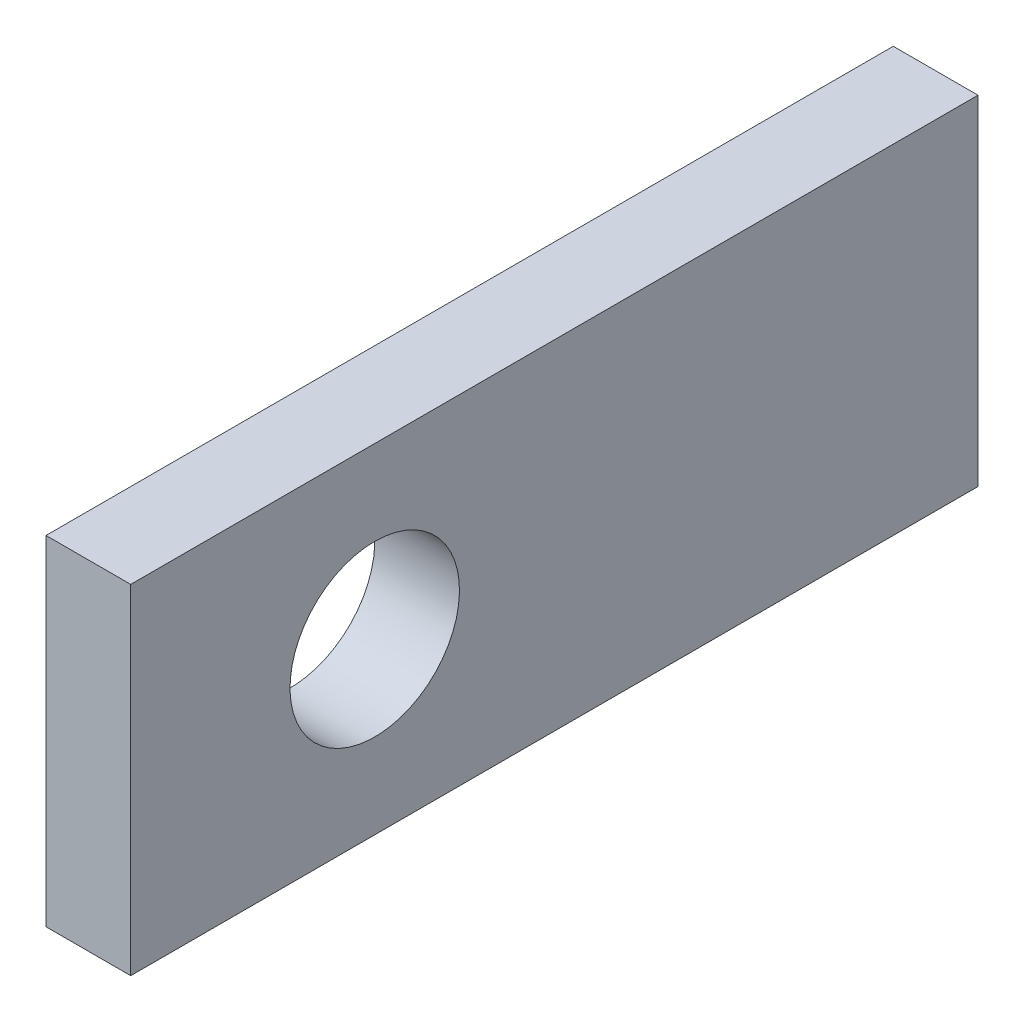
ISO-10303-21;
HEADER;
FILE_DESCRIPTION(('STEP AP214'),'2;1');
FILE_NAME('part.step','',(''),(''),'','','');
FILE_SCHEMA(('AUTOMOTIVE_DESIGN { 1 0 10303 214 1 1 1 1 }'));
ENDSEC;
DATA;
#1=APPLICATION_CONTEXT('core data for automotive mechanical design processes');
#2=APPLICATION_PROTOCOL_DEFINITION('international standard','automotive_design',2000,#1);
#3=PRODUCT_CONTEXT('',#1,'mechanical');
#4=PRODUCT('Part','Part','',(#3));
#5=PRODUCT_RELATED_PRODUCT_CATEGORY('part','',(#4));
#6=PRODUCT_DEFINITION_FORMATION('','',#4);
#7=PRODUCT_DEFINITION_CONTEXT('part definition',#1,'design');
#8=PRODUCT_DEFINITION('design','',#6,#7);
#9=PRODUCT_DEFINITION_SHAPE('','',#8);
#10=(LENGTH_UNIT() NAMED_UNIT(*) SI_UNIT(.MILLI.,.METRE.));
#11=(NAMED_UNIT(*) PLANE_ANGLE_UNIT() SI_UNIT($,.RADIAN.));
#12=(NAMED_UNIT(*) SI_UNIT($,.STERADIAN.) SOLID_ANGLE_UNIT());
#13=UNCERTAINTY_MEASURE_WITH_UNIT(LENGTH_MEASURE(1.E-05),#10,'distance_accuracy_value','');
#14=(GEOMETRIC_REPRESENTATION_CONTEXT(3) GLOBAL_UNCERTAINTY_ASSIGNED_CONTEXT((#13)) GLOBAL_UNIT_ASSIGNED_CONTEXT((#10,
#11,#12)) REPRESENTATION_CONTEXT('',''));
#15=CARTESIAN_POINT('',(0.,0.,0.));
#16=DIRECTION('',(0.,0.,1.));
#17=DIRECTION('',(1.,0.,0.));
#18=AXIS2_PLACEMENT_3D('',#15,#16,#17);
#19=CARTESIAN_POINT('',(31.9112172452505,7.50405278369165,31.75));
#20=DIRECTION('',(1.,0.,0.));
#21=DIRECTION('',(0.,0.,-1.));
#22=AXIS2_PLACEMENT_3D('',#19,#20,#21);
#23=PLANE('',#22);
#24=CARTESIAN_POINT('',(31.9112172452505,1.15405278369165,22.606));
#25=DIRECTION('',(1.,0.,0.));
#26=DIRECTION('',(0.,1.,0.));
#27=AXIS2_PLACEMENT_3D('',#24,#25,#26);
#28=CIRCLE('',#27,3.175);
#29=CARTESIAN_POINT('',(31.9112172452505,4.32905278369165,22.606));
#30=VERTEX_POINT('',#29);
#31=EDGE_CURVE('E99',#30,#30,#28,.T.);
#32=ORIENTED_EDGE('',*,*,#31,.T.);
#33=EDGE_LOOP('',(#32));
#34=FACE_BOUND('',#33,.T.);
#35=DIRECTION('',(0.,-1.,0.));
#36=VECTOR('',#35,1.);
#37=CARTESIAN_POINT('',(31.9112172452505,7.50405278369165,0.));
#38=LINE('',#37,#36);
#39=CARTESIAN_POINT('',(31.9112172452505,7.50405278369165,0.));
#40=VERTEX_POINT('',#39);
#41=CARTESIAN_POINT('',(31.9112172452505,-5.19594721630835,0.));
#42=VERTEX_POINT('',#41);
#43=EDGE_CURVE('E96',#40,#42,#38,.T.);
#44=ORIENTED_EDGE('',*,*,#43,.T.);
#45=DIRECTION('',(0.,0.,-1.));
#46=VECTOR('',#45,1.);
#47=CARTESIAN_POINT('',(31.9112172452505,-5.19594721630835,31.75));
#48=LINE('',#47,#46);
#49=CARTESIAN_POINT('',(31.9112172452505,-5.19594721630835,31.75));
#50=VERTEX_POINT('',#49);
#51=EDGE_CURVE('E11',#50,#42,#48,.T.);
#52=ORIENTED_EDGE('',*,*,#51,.F.);
#53=DIRECTION('',(0.,-1.,0.));
#54=VECTOR('',#53,1.);
#55=CARTESIAN_POINT('',(31.9112172452505,7.50405278369165,31.75));
#56=LINE('',#55,#54);
#57=CARTESIAN_POINT('',(31.9112172452505,7.50405278369165,31.75));
#58=VERTEX_POINT('',#57);
#59=EDGE_CURVE('E84',#58,#50,#56,.T.);
#60=ORIENTED_EDGE('',*,*,#59,.F.);
#61=DIRECTION('',(0.,0.,-1.));
#62=VECTOR('',#61,1.);
#63=CARTESIAN_POINT('',(31.9112172452505,7.50405278369165,31.75));
#64=LINE('',#63,#62);
#65=EDGE_CURVE('E92',#58,#40,#64,.T.);
#66=ORIENTED_EDGE('',*,*,#65,.T.);
#67=EDGE_LOOP('',(#44,#52,#60,#66));
#68=FACE_BOUND('',#67,.T.);
#69=ADVANCED_FACE('F33',(#34,#68),#23,.F.);
#70=CARTESIAN_POINT('',(31.9112172452505,-5.19594721630835,31.75));
#71=DIRECTION('',(0.,1.,0.));
#72=DIRECTION('',(0.,0.,1.));
#73=AXIS2_PLACEMENT_3D('',#70,#71,#72);
#74=PLANE('',#73);
#75=DIRECTION('',(1.,0.,0.));
#76=VECTOR('',#75,1.);
#77=CARTESIAN_POINT('',(31.9112172452505,-5.19594721630835,0.));
#78=LINE('',#77,#76);
#79=CARTESIAN_POINT('',(35.0862172452505,-5.19594721630835,0.));
#80=VERTEX_POINT('',#79);
#81=EDGE_CURVE('E88',#42,#80,#78,.T.);
#82=ORIENTED_EDGE('',*,*,#81,.T.);
#83=DIRECTION('',(0.,0.,-1.));
#84=VECTOR('',#83,1.);
#85=CARTESIAN_POINT('',(35.0862172452505,-5.19594721630835,31.75));
#86=LINE('',#85,#84);
#87=CARTESIAN_POINT('',(35.0862172452505,-5.19594721630835,31.75));
#88=VERTEX_POINT('',#87);
#89=EDGE_CURVE('E41',#88,#80,#86,.T.);
#90=ORIENTED_EDGE('',*,*,#89,.F.);
#91=DIRECTION('',(1.,0.,0.));
#92=VECTOR('',#91,1.);
#93=CARTESIAN_POINT('',(31.9112172452505,-5.19594721630835,31.75));
#94=LINE('',#93,#92);
#95=EDGE_CURVE('E79',#50,#88,#94,.T.);
#96=ORIENTED_EDGE('',*,*,#95,.F.);
#97=ORIENTED_EDGE('',*,*,#51,.T.);
#98=EDGE_LOOP('',(#82,#90,#96,#97));
#99=FACE_BOUND('',#98,.T.);
#100=ADVANCED_FACE('F87',(#99),#74,.F.);
#101=CARTESIAN_POINT('',(35.0862172452505,7.50405278369165,31.75));
#102=DIRECTION('',(-1.,0.,0.));
#103=DIRECTION('',(0.,0.,1.));
#104=AXIS2_PLACEMENT_3D('',#101,#102,#103);
#105=PLANE('',#104);
#106=CARTESIAN_POINT('',(35.0862172452505,1.15405278369165,22.606));
#107=DIRECTION('',(1.,0.,0.));
#108=DIRECTION('',(0.,1.,0.));
#109=AXIS2_PLACEMENT_3D('',#106,#107,#108);
#110=CIRCLE('',#109,3.175);
#111=CARTESIAN_POINT('',(35.0862172452505,4.32905278369165,22.606));
#112=VERTEX_POINT('',#111);
#113=EDGE_CURVE('E110',#112,#112,#110,.T.);
#114=ORIENTED_EDGE('',*,*,#113,.F.);
#115=EDGE_LOOP('',(#114));
#116=FACE_BOUND('',#115,.T.);
#117=DIRECTION('',(0.,1.,0.));
#118=VECTOR('',#117,1.);
#119=CARTESIAN_POINT('',(35.0862172452505,7.50405278369165,0.));
#120=LINE('',#119,#118);
#121=CARTESIAN_POINT('',(35.0862172452505,7.50405278369165,0.));
#122=VERTEX_POINT('',#121);
#123=EDGE_CURVE('E66',#80,#122,#120,.T.);
#124=ORIENTED_EDGE('',*,*,#123,.T.);
#125=DIRECTION('',(0.,0.,-1.));
#126=VECTOR('',#125,1.);
#127=CARTESIAN_POINT('',(35.0862172452505,7.50405278369165,31.75));
#128=LINE('',#127,#126);
#129=CARTESIAN_POINT('',(35.0862172452505,7.50405278369165,31.75));
#130=VERTEX_POINT('',#129);
#131=EDGE_CURVE('E89',#130,#122,#128,.T.);
#132=ORIENTED_EDGE('',*,*,#131,.F.);
#133=DIRECTION('',(0.,1.,0.));
#134=VECTOR('',#133,1.);
#135=CARTESIAN_POINT('',(35.0862172452505,7.50405278369165,31.75));
#136=LINE('',#135,#134);
#137=EDGE_CURVE('E82',#88,#130,#136,.T.);
#138=ORIENTED_EDGE('',*,*,#137,.F.);
#139=ORIENTED_EDGE('',*,*,#89,.T.);
#140=EDGE_LOOP('',(#124,#132,#138,#139));
#141=FACE_BOUND('',#140,.T.);
#142=ADVANCED_FACE('F90',(#116,#141),#105,.F.);
#143=CARTESIAN_POINT('',(31.9112172452505,7.50405278369165,31.75));
#144=DIRECTION('',(0.,-1.,0.));
#145=DIRECTION('',(0.,0.,-1.));
#146=AXIS2_PLACEMENT_3D('',#143,#144,#145);
#147=PLANE('',#146);
#148=DIRECTION('',(-1.,0.,0.));
#149=VECTOR('',#148,1.);
#150=CARTESIAN_POINT('',(31.9112172452505,7.50405278369165,0.));
#151=LINE('',#150,#149);
#152=EDGE_CURVE('E72',#122,#40,#151,.T.);
#153=ORIENTED_EDGE('',*,*,#152,.T.);
#154=ORIENTED_EDGE('',*,*,#65,.F.);
#155=DIRECTION('',(-1.,0.,0.));
#156=VECTOR('',#155,1.);
#157=CARTESIAN_POINT('',(31.9112172452505,7.50405278369165,31.75));
#158=LINE('',#157,#156);
#159=EDGE_CURVE('E49',#130,#58,#158,.T.);
#160=ORIENTED_EDGE('',*,*,#159,.F.);
#161=ORIENTED_EDGE('',*,*,#131,.T.);
#162=EDGE_LOOP('',(#153,#154,#160,#161));
#163=FACE_BOUND('',#162,.T.);
#164=ADVANCED_FACE('F104',(#163),#147,.F.);
#165=CARTESIAN_POINT('',(0.,0.,31.75));
#166=DIRECTION('',(0.,0.,1.));
#167=DIRECTION('',(1.,0.,0.));
#168=AXIS2_PLACEMENT_3D('',#165,#166,#167);
#169=PLANE('',#168);
#170=ORIENTED_EDGE('',*,*,#59,.T.);
#171=ORIENTED_EDGE('',*,*,#95,.T.);
#172=ORIENTED_EDGE('',*,*,#137,.T.);
#173=ORIENTED_EDGE('',*,*,#159,.T.);
#174=EDGE_LOOP('',(#170,#171,#172,#173));
#175=FACE_BOUND('',#174,.T.);
#176=ADVANCED_FACE('F80',(#175),#169,.T.);
#177=CARTESIAN_POINT('',(0.,0.,0.));
#178=DIRECTION('',(0.,0.,1.));
#179=DIRECTION('',(1.,0.,0.));
#180=AXIS2_PLACEMENT_3D('',#177,#178,#179);
#181=PLANE('',#180);
#182=ORIENTED_EDGE('',*,*,#43,.F.);
#183=ORIENTED_EDGE('',*,*,#152,.F.);
#184=ORIENTED_EDGE('',*,*,#123,.F.);
#185=ORIENTED_EDGE('',*,*,#81,.F.);
#186=EDGE_LOOP('',(#182,#183,#184,#185));
#187=FACE_BOUND('',#186,.T.);
#188=ADVANCED_FACE('F107',(#187),#181,.F.);
#189=CARTESIAN_POINT('',(31.9112172452505,1.15405278369165,22.606));
#190=DIRECTION('',(1.,0.,0.));
#191=DIRECTION('',(0.,1.,0.));
#192=AXIS2_PLACEMENT_3D('',#189,#190,#191);
#193=CYLINDRICAL_SURFACE('',#192,3.175);
#194=ORIENTED_EDGE('',*,*,#31,.F.);
#195=EDGE_LOOP('',(#194));
#196=FACE_BOUND('',#195,.T.);
#197=ORIENTED_EDGE('',*,*,#113,.T.);
#198=EDGE_LOOP('',(#197));
#199=FACE_BOUND('',#198,.T.);
#200=ADVANCED_FACE('F117',(#196,#199),#193,.F.);
#201=CLOSED_SHELL('',(#69,#100,#142,#164,#176,#188,#200));
#202=MANIFOLD_SOLID_BREP('B2',#201);
#203=ADVANCED_BREP_SHAPE_REPRESENTATION('',(#18,#202),#14);
#204=SHAPE_DEFINITION_REPRESENTATION(#9,#203);
ENDSEC;
END-ISO-10303-21;
